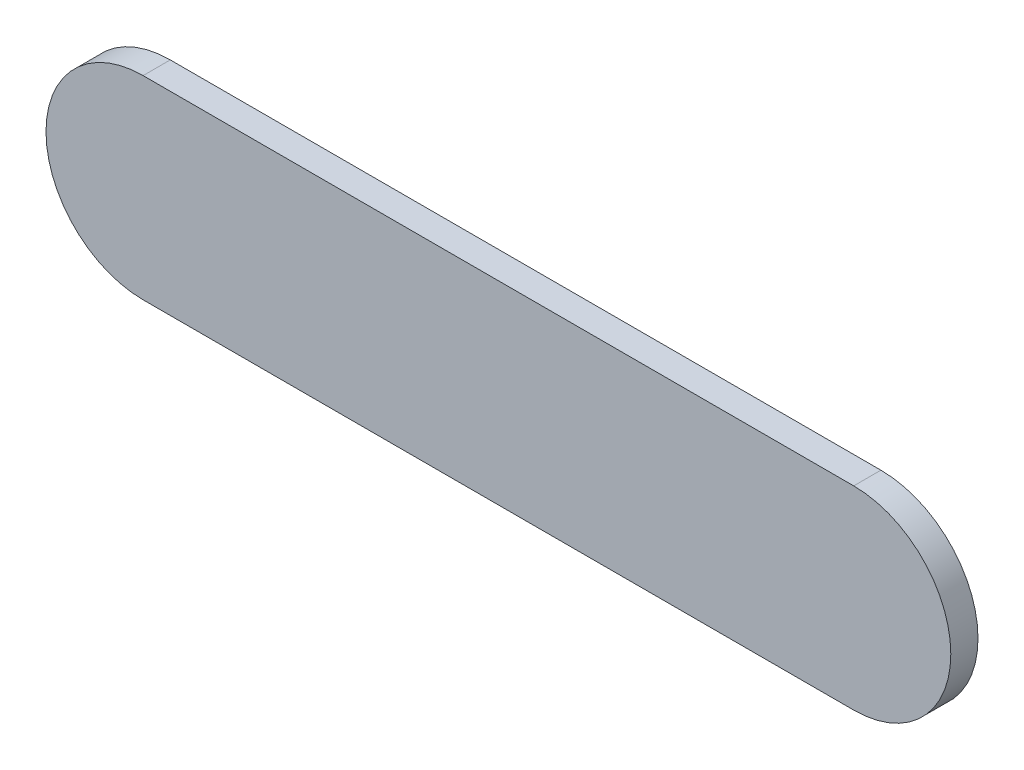
ISO-10303-21;
HEADER;
FILE_DESCRIPTION(('STEP AP214'),'2;1');
FILE_NAME('part.step','',(''),(''),'','','');
FILE_SCHEMA(('AUTOMOTIVE_DESIGN { 1 0 10303 214 1 1 1 1 }'));
ENDSEC;
DATA;
#1=APPLICATION_CONTEXT('core data for automotive mechanical design processes');
#2=APPLICATION_PROTOCOL_DEFINITION('international standard','automotive_design',2000,#1);
#3=PRODUCT_CONTEXT('',#1,'mechanical');
#4=PRODUCT('Part','Part','',(#3));
#5=PRODUCT_RELATED_PRODUCT_CATEGORY('part','',(#4));
#6=PRODUCT_DEFINITION_FORMATION('','',#4);
#7=PRODUCT_DEFINITION_CONTEXT('part definition',#1,'design');
#8=PRODUCT_DEFINITION('design','',#6,#7);
#9=PRODUCT_DEFINITION_SHAPE('','',#8);
#10=(LENGTH_UNIT() NAMED_UNIT(*) SI_UNIT(.MILLI.,.METRE.));
#11=(NAMED_UNIT(*) PLANE_ANGLE_UNIT() SI_UNIT($,.RADIAN.));
#12=(NAMED_UNIT(*) SI_UNIT($,.STERADIAN.) SOLID_ANGLE_UNIT());
#13=UNCERTAINTY_MEASURE_WITH_UNIT(LENGTH_MEASURE(1.E-05),#10,'distance_accuracy_value','');
#14=(GEOMETRIC_REPRESENTATION_CONTEXT(3) GLOBAL_UNCERTAINTY_ASSIGNED_CONTEXT((#13)) GLOBAL_UNIT_ASSIGNED_CONTEXT((#10,
#11,#12)) REPRESENTATION_CONTEXT('',''));
#15=CARTESIAN_POINT('',(0.,0.,0.));
#16=DIRECTION('',(0.,0.,1.));
#17=DIRECTION('',(1.,0.,0.));
#18=AXIS2_PLACEMENT_3D('',#15,#16,#17);
#19=CARTESIAN_POINT('',(88.42626206,91.32500658,0.));
#20=DIRECTION('',(0.,1.,0.));
#21=DIRECTION('',(1.,0.,0.));
#22=AXIS2_PLACEMENT_3D('',#19,#20,#21);
#23=PLANE('',#22);
#24=DIRECTION('',(1.,0.,0.));
#25=VECTOR('',#24,1.);
#26=CARTESIAN_POINT('',(88.42626206,91.32500658,0.03556));
#27=LINE('',#26,#25);
#28=CARTESIAN_POINT('',(88.42626206,91.32500658,0.03556));
#29=VERTEX_POINT('',#28);
#30=CARTESIAN_POINT('',(89.35575474,91.32500658,0.03556));
#31=VERTEX_POINT('',#30);
#32=EDGE_CURVE('E11',#29,#31,#27,.T.);
#33=ORIENTED_EDGE('',*,*,#32,.F.);
#34=DIRECTION('',(0.,0.,1.));
#35=VECTOR('',#34,1.);
#36=CARTESIAN_POINT('',(88.42626206,91.32500658,0.));
#37=LINE('',#36,#35);
#38=CARTESIAN_POINT('',(88.42626206,91.32500658,0.));
#39=VERTEX_POINT('',#38);
#40=EDGE_CURVE('E24',#39,#29,#37,.T.);
#41=ORIENTED_EDGE('',*,*,#40,.F.);
#42=DIRECTION('',(1.,0.,0.));
#43=VECTOR('',#42,1.);
#44=CARTESIAN_POINT('',(88.42626206,91.32500658,0.));
#45=LINE('',#44,#43);
#46=CARTESIAN_POINT('',(89.35575474,91.32500658,0.));
#47=VERTEX_POINT('',#46);
#48=EDGE_CURVE('E75',#39,#47,#45,.T.);
#49=ORIENTED_EDGE('',*,*,#48,.T.);
#50=DIRECTION('',(0.,0.,1.));
#51=VECTOR('',#50,1.);
#52=CARTESIAN_POINT('',(89.35575474,91.32500658,0.));
#53=LINE('',#52,#51);
#54=EDGE_CURVE('E37',#47,#31,#53,.T.);
#55=ORIENTED_EDGE('',*,*,#54,.T.);
#56=EDGE_LOOP('',(#33,#41,#49,#55));
#57=FACE_BOUND('',#56,.T.);
#58=ADVANCED_FACE('F17',(#57),#23,.F.);
#59=CARTESIAN_POINT('',(89.35575474,91.45200658,0.));
#60=DIRECTION('',(0.,0.,-1.));
#61=DIRECTION('',(1.11896493820492E-13,-1.,0.));
#62=AXIS2_PLACEMENT_3D('',#59,#60,#61);
#63=CYLINDRICAL_SURFACE('',#62,0.127000000000005);
#64=CARTESIAN_POINT('',(89.35575474,91.45200658,0.03556));
#65=DIRECTION('',(0.,0.,1.));
#66=DIRECTION('',(1.11896493820492E-13,-1.,0.));
#67=AXIS2_PLACEMENT_3D('',#64,#65,#66);
#68=CIRCLE('',#67,0.127000000000005);
#69=CARTESIAN_POINT('',(89.35575474,91.57900658,0.03556));
#70=VERTEX_POINT('',#69);
#71=EDGE_CURVE('E83',#31,#70,#68,.T.);
#72=ORIENTED_EDGE('',*,*,#71,.F.);
#73=ORIENTED_EDGE('',*,*,#54,.F.);
#74=CARTESIAN_POINT('',(89.35575474,91.45200658,0.));
#75=DIRECTION('',(0.,0.,1.));
#76=DIRECTION('',(1.11896493820492E-13,-1.,0.));
#77=AXIS2_PLACEMENT_3D('',#74,#75,#76);
#78=CIRCLE('',#77,0.127000000000005);
#79=CARTESIAN_POINT('',(89.35575474,91.57900658,0.));
#80=VERTEX_POINT('',#79);
#81=EDGE_CURVE('E81',#47,#80,#78,.T.);
#82=ORIENTED_EDGE('',*,*,#81,.T.);
#83=DIRECTION('',(0.,0.,1.));
#84=VECTOR('',#83,1.);
#85=CARTESIAN_POINT('',(89.35575474,91.57900658,0.));
#86=LINE('',#85,#84);
#87=EDGE_CURVE('E67',#80,#70,#86,.T.);
#88=ORIENTED_EDGE('',*,*,#87,.T.);
#89=EDGE_LOOP('',(#72,#73,#82,#88));
#90=FACE_BOUND('',#89,.T.);
#91=ADVANCED_FACE('F89',(#90),#63,.T.);
#92=CARTESIAN_POINT('',(89.35575474,91.57900658,0.));
#93=DIRECTION('',(0.,-1.,0.));
#94=DIRECTION('',(-1.,0.,0.));
#95=AXIS2_PLACEMENT_3D('',#92,#93,#94);
#96=PLANE('',#95);
#97=DIRECTION('',(-1.,0.,0.));
#98=VECTOR('',#97,1.);
#99=CARTESIAN_POINT('',(89.35575474,91.57900658,0.03556));
#100=LINE('',#99,#98);
#101=CARTESIAN_POINT('',(88.42626206,91.57900658,0.03556));
#102=VERTEX_POINT('',#101);
#103=EDGE_CURVE('E71',#70,#102,#100,.T.);
#104=ORIENTED_EDGE('',*,*,#103,.F.);
#105=ORIENTED_EDGE('',*,*,#87,.F.);
#106=DIRECTION('',(-1.,0.,0.));
#107=VECTOR('',#106,1.);
#108=CARTESIAN_POINT('',(89.35575474,91.57900658,0.));
#109=LINE('',#108,#107);
#110=CARTESIAN_POINT('',(88.42626206,91.57900658,0.));
#111=VERTEX_POINT('',#110);
#112=EDGE_CURVE('E63',#80,#111,#109,.T.);
#113=ORIENTED_EDGE('',*,*,#112,.T.);
#114=DIRECTION('',(0.,0.,1.));
#115=VECTOR('',#114,1.);
#116=CARTESIAN_POINT('',(88.42626206,91.57900658,0.));
#117=LINE('',#116,#115);
#118=EDGE_CURVE('E53',#111,#102,#117,.T.);
#119=ORIENTED_EDGE('',*,*,#118,.T.);
#120=EDGE_LOOP('',(#104,#105,#113,#119));
#121=FACE_BOUND('',#120,.T.);
#122=ADVANCED_FACE('F66',(#121),#96,.F.);
#123=CARTESIAN_POINT('',(88.42626206,91.45200658,0.));
#124=DIRECTION('',(0.,0.,-1.));
#125=DIRECTION('',(-1.1189649382048E-13,1.,0.));
#126=AXIS2_PLACEMENT_3D('',#123,#124,#125);
#127=CYLINDRICAL_SURFACE('',#126,0.127000000000005);
#128=CARTESIAN_POINT('',(88.42626206,91.45200658,0.03556));
#129=DIRECTION('',(0.,0.,1.));
#130=DIRECTION('',(-1.1189649382048E-13,1.,0.));
#131=AXIS2_PLACEMENT_3D('',#128,#129,#130);
#132=CIRCLE('',#131,0.127000000000005);
#133=EDGE_CURVE('E59',#102,#29,#132,.T.);
#134=ORIENTED_EDGE('',*,*,#133,.F.);
#135=ORIENTED_EDGE('',*,*,#118,.F.);
#136=CARTESIAN_POINT('',(88.42626206,91.45200658,0.));
#137=DIRECTION('',(0.,0.,1.));
#138=DIRECTION('',(-1.1189649382048E-13,1.,0.));
#139=AXIS2_PLACEMENT_3D('',#136,#137,#138);
#140=CIRCLE('',#139,0.127000000000005);
#141=EDGE_CURVE('E57',#111,#39,#140,.T.);
#142=ORIENTED_EDGE('',*,*,#141,.T.);
#143=ORIENTED_EDGE('',*,*,#40,.T.);
#144=EDGE_LOOP('',(#134,#135,#142,#143));
#145=FACE_BOUND('',#144,.T.);
#146=ADVANCED_FACE('F55',(#145),#127,.T.);
#147=CARTESIAN_POINT('',(88.42626206,91.32500658,0.));
#148=DIRECTION('',(0.,0.,-1.));
#149=DIRECTION('',(-1.,0.,0.));
#150=AXIS2_PLACEMENT_3D('',#147,#148,#149);
#151=PLANE('',#150);
#152=ORIENTED_EDGE('',*,*,#141,.F.);
#153=ORIENTED_EDGE('',*,*,#112,.F.);
#154=ORIENTED_EDGE('',*,*,#81,.F.);
#155=ORIENTED_EDGE('',*,*,#48,.F.);
#156=EDGE_LOOP('',(#152,#153,#154,#155));
#157=FACE_BOUND('',#156,.T.);
#158=ADVANCED_FACE('F74',(#157),#151,.T.);
#159=CARTESIAN_POINT('',(88.42626206,91.32500658,0.03556));
#160=DIRECTION('',(0.,0.,-1.));
#161=DIRECTION('',(-1.,0.,0.));
#162=AXIS2_PLACEMENT_3D('',#159,#160,#161);
#163=PLANE('',#162);
#164=ORIENTED_EDGE('',*,*,#32,.T.);
#165=ORIENTED_EDGE('',*,*,#71,.T.);
#166=ORIENTED_EDGE('',*,*,#103,.T.);
#167=ORIENTED_EDGE('',*,*,#133,.T.);
#168=EDGE_LOOP('',(#164,#165,#166,#167));
#169=FACE_BOUND('',#168,.T.);
#170=ADVANCED_FACE('F91',(#169),#163,.F.);
#171=CLOSED_SHELL('',(#58,#91,#122,#146,#158,#170));
#172=MANIFOLD_SOLID_BREP('B1',#171);
#173=ADVANCED_BREP_SHAPE_REPRESENTATION('',(#18,#172),#14);
#174=SHAPE_DEFINITION_REPRESENTATION(#9,#173);
ENDSEC;
END-ISO-10303-21;
